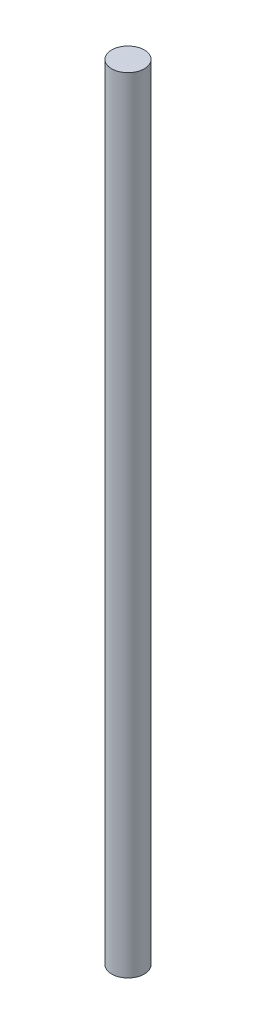
ISO-10303-21;
HEADER;
FILE_DESCRIPTION(('STEP AP214'),'2;1');
FILE_NAME('part.step','',(''),(''),'','','');
FILE_SCHEMA(('AUTOMOTIVE_DESIGN { 1 0 10303 214 1 1 1 1 }'));
ENDSEC;
DATA;
#1=APPLICATION_CONTEXT('core data for automotive mechanical design processes');
#2=APPLICATION_PROTOCOL_DEFINITION('international standard','automotive_design',2000,#1);
#3=PRODUCT_CONTEXT('',#1,'mechanical');
#4=PRODUCT('Part','Part','',(#3));
#5=PRODUCT_RELATED_PRODUCT_CATEGORY('part','',(#4));
#6=PRODUCT_DEFINITION_FORMATION('','',#4);
#7=PRODUCT_DEFINITION_CONTEXT('part definition',#1,'design');
#8=PRODUCT_DEFINITION('design','',#6,#7);
#9=PRODUCT_DEFINITION_SHAPE('','',#8);
#10=(LENGTH_UNIT() NAMED_UNIT(*) SI_UNIT(.MILLI.,.METRE.));
#11=(NAMED_UNIT(*) PLANE_ANGLE_UNIT() SI_UNIT($,.RADIAN.));
#12=(NAMED_UNIT(*) SI_UNIT($,.STERADIAN.) SOLID_ANGLE_UNIT());
#13=UNCERTAINTY_MEASURE_WITH_UNIT(LENGTH_MEASURE(1.E-05),#10,'distance_accuracy_value','');
#14=(GEOMETRIC_REPRESENTATION_CONTEXT(3) GLOBAL_UNCERTAINTY_ASSIGNED_CONTEXT((#13)) GLOBAL_UNIT_ASSIGNED_CONTEXT((#10,
#11,#12)) REPRESENTATION_CONTEXT('',''));
#15=CARTESIAN_POINT('',(0.,0.,0.));
#16=DIRECTION('',(0.,0.,1.));
#17=DIRECTION('',(1.,0.,0.));
#18=AXIS2_PLACEMENT_3D('',#15,#16,#17);
#19=CARTESIAN_POINT('',(0.,304.8,0.));
#20=DIRECTION('',(0.,-1.,0.));
#21=DIRECTION('',(0.,0.,-1.));
#22=AXIS2_PLACEMENT_3D('',#19,#20,#21);
#23=CYLINDRICAL_SURFACE('',#22,6.35);
#24=CARTESIAN_POINT('',(0.,304.8,0.));
#25=DIRECTION('',(0.,1.,0.));
#26=DIRECTION('',(0.,0.,1.));
#27=AXIS2_PLACEMENT_3D('',#24,#25,#26);
#28=CIRCLE('',#27,6.35);
#29=CARTESIAN_POINT('',(0.,304.8,6.35));
#30=VERTEX_POINT('',#29);
#31=EDGE_CURVE('E10',#30,#30,#28,.T.);
#32=ORIENTED_EDGE('',*,*,#31,.F.);
#33=EDGE_LOOP('',(#32));
#34=FACE_BOUND('',#33,.T.);
#35=CARTESIAN_POINT('',(0.,0.,0.));
#36=DIRECTION('',(0.,1.,0.));
#37=DIRECTION('',(0.,0.,1.));
#38=AXIS2_PLACEMENT_3D('',#35,#36,#37);
#39=CIRCLE('',#38,6.35);
#40=CARTESIAN_POINT('',(0.,0.,6.35));
#41=VERTEX_POINT('',#40);
#42=EDGE_CURVE('E34',#41,#41,#39,.T.);
#43=ORIENTED_EDGE('',*,*,#42,.T.);
#44=EDGE_LOOP('',(#43));
#45=FACE_BOUND('',#44,.T.);
#46=ADVANCED_FACE('F31',(#34,#45),#23,.T.);
#47=CARTESIAN_POINT('',(0.,304.8,0.));
#48=DIRECTION('',(0.,1.,0.));
#49=DIRECTION('',(0.,0.,1.));
#50=AXIS2_PLACEMENT_3D('',#47,#48,#49);
#51=PLANE('',#50);
#52=ORIENTED_EDGE('',*,*,#31,.T.);
#53=EDGE_LOOP('',(#52));
#54=FACE_BOUND('',#53,.T.);
#55=ADVANCED_FACE('F46',(#54),#51,.T.);
#56=CARTESIAN_POINT('',(0.,0.,0.));
#57=DIRECTION('',(0.,1.,0.));
#58=DIRECTION('',(0.,0.,1.));
#59=AXIS2_PLACEMENT_3D('',#56,#57,#58);
#60=PLANE('',#59);
#61=ORIENTED_EDGE('',*,*,#42,.F.);
#62=EDGE_LOOP('',(#61));
#63=FACE_BOUND('',#62,.T.);
#64=ADVANCED_FACE('F44',(#63),#60,.F.);
#65=CLOSED_SHELL('',(#46,#55,#64));
#66=MANIFOLD_SOLID_BREP('B2',#65);
#67=ADVANCED_BREP_SHAPE_REPRESENTATION('',(#18,#66),#14);
#68=SHAPE_DEFINITION_REPRESENTATION(#9,#67);
ENDSEC;
END-ISO-10303-21;
